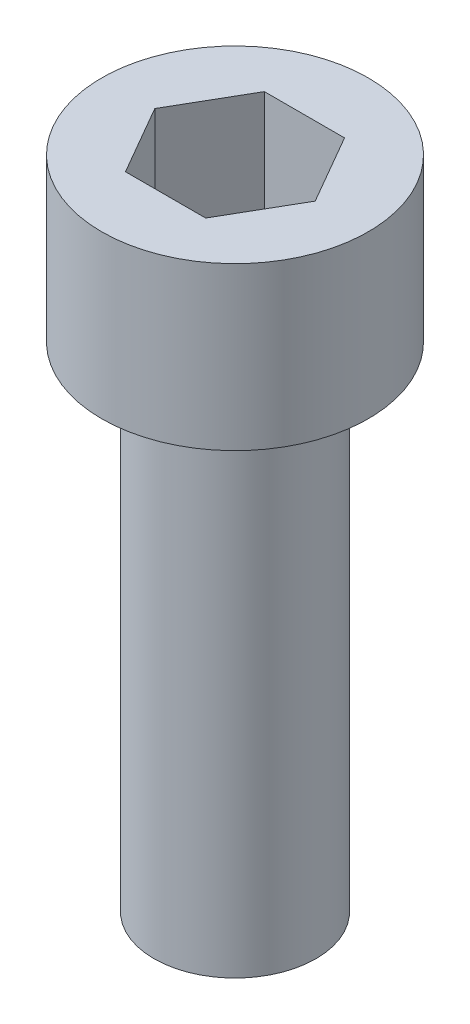
ISO-10303-21;
HEADER;
FILE_DESCRIPTION(('STEP AP214'),'2;1');
FILE_NAME('part.step','',(''),(''),'','','');
FILE_SCHEMA(('AUTOMOTIVE_DESIGN { 1 0 10303 214 1 1 1 1 }'));
ENDSEC;
DATA;
#1=APPLICATION_CONTEXT('core data for automotive mechanical design processes');
#2=APPLICATION_PROTOCOL_DEFINITION('international standard','automotive_design',2000,#1);
#3=PRODUCT_CONTEXT('',#1,'mechanical');
#4=PRODUCT('Part','Part','',(#3));
#5=PRODUCT_RELATED_PRODUCT_CATEGORY('part','',(#4));
#6=PRODUCT_DEFINITION_FORMATION('','',#4);
#7=PRODUCT_DEFINITION_CONTEXT('part definition',#1,'design');
#8=PRODUCT_DEFINITION('design','',#6,#7);
#9=PRODUCT_DEFINITION_SHAPE('','',#8);
#10=(LENGTH_UNIT() NAMED_UNIT(*) SI_UNIT(.MILLI.,.METRE.));
#11=(NAMED_UNIT(*) PLANE_ANGLE_UNIT() SI_UNIT($,.RADIAN.));
#12=(NAMED_UNIT(*) SI_UNIT($,.STERADIAN.) SOLID_ANGLE_UNIT());
#13=UNCERTAINTY_MEASURE_WITH_UNIT(LENGTH_MEASURE(1.E-05),#10,'distance_accuracy_value','');
#14=(GEOMETRIC_REPRESENTATION_CONTEXT(3) GLOBAL_UNCERTAINTY_ASSIGNED_CONTEXT((#13)) GLOBAL_UNIT_ASSIGNED_CONTEXT((#10,
#11,#12)) REPRESENTATION_CONTEXT('',''));
#15=CARTESIAN_POINT('',(0.,0.,0.));
#16=DIRECTION('',(0.,0.,1.));
#17=DIRECTION('',(1.,0.,0.));
#18=AXIS2_PLACEMENT_3D('',#15,#16,#17);
#19=CARTESIAN_POINT('',(0.,4.1656,0.));
#20=DIRECTION('',(0.,-1.,0.));
#21=DIRECTION('',(0.,0.,-1.));
#22=AXIS2_PLACEMENT_3D('',#19,#20,#21);
#23=PLANE('',#22);
#24=DIRECTION('',(-0.5,0.,-0.866025403784438));
#25=VECTOR('',#24,1.);
#26=CARTESIAN_POINT('',(2.06222299276169,4.1656,0.));
#27=LINE('',#26,#25);
#28=CARTESIAN_POINT('',(2.06222299276169,4.1656,0.));
#29=VERTEX_POINT('',#28);
#30=CARTESIAN_POINT('',(1.03111149638085,4.1656,-1.7859375));
#31=VERTEX_POINT('',#30);
#32=EDGE_CURVE('E122',#29,#31,#27,.T.);
#33=ORIENTED_EDGE('',*,*,#32,.F.);
#34=DIRECTION('',(0.5,0.,-0.866025403784439));
#35=VECTOR('',#34,1.);
#36=CARTESIAN_POINT('',(1.03111149638085,4.1656,1.7859375));
#37=LINE('',#36,#35);
#38=CARTESIAN_POINT('',(1.03111149638085,4.1656,1.7859375));
#39=VERTEX_POINT('',#38);
#40=EDGE_CURVE('E48',#39,#29,#37,.T.);
#41=ORIENTED_EDGE('',*,*,#40,.F.);
#42=DIRECTION('',(1.,0.,0.));
#43=VECTOR('',#42,1.);
#44=CARTESIAN_POINT('',(-1.03111149638085,4.1656,1.7859375));
#45=LINE('',#44,#43);
#46=CARTESIAN_POINT('',(-1.03111149638085,4.1656,1.7859375));
#47=VERTEX_POINT('',#46);
#48=EDGE_CURVE('E131',#47,#39,#45,.T.);
#49=ORIENTED_EDGE('',*,*,#48,.F.);
#50=DIRECTION('',(0.5,0.,0.866025403784438));
#51=VECTOR('',#50,1.);
#52=CARTESIAN_POINT('',(-2.06222299276169,4.1656,0.));
#53=LINE('',#52,#51);
#54=CARTESIAN_POINT('',(-2.06222299276169,4.1656,0.));
#55=VERTEX_POINT('',#54);
#56=EDGE_CURVE('E129',#55,#47,#53,.T.);
#57=ORIENTED_EDGE('',*,*,#56,.F.);
#58=DIRECTION('',(-0.5,0.,0.866025403784439));
#59=VECTOR('',#58,1.);
#60=CARTESIAN_POINT('',(-1.03111149638085,4.1656,-1.7859375));
#61=LINE('',#60,#59);
#62=CARTESIAN_POINT('',(-1.03111149638085,4.1656,-1.7859375));
#63=VERTEX_POINT('',#62);
#64=EDGE_CURVE('E96',#63,#55,#61,.T.);
#65=ORIENTED_EDGE('',*,*,#64,.F.);
#66=DIRECTION('',(-1.,0.,0.));
#67=VECTOR('',#66,1.);
#68=CARTESIAN_POINT('',(1.03111149638085,4.1656,-1.7859375));
#69=LINE('',#68,#67);
#70=EDGE_CURVE('E125',#31,#63,#69,.T.);
#71=ORIENTED_EDGE('',*,*,#70,.F.);
#72=EDGE_LOOP('',(#33,#41,#49,#57,#65,#71));
#73=FACE_BOUND('',#72,.T.);
#74=CARTESIAN_POINT('',(0.,4.1656,0.));
#75=DIRECTION('',(0.,1.,0.));
#76=DIRECTION('',(0.,0.,1.));
#77=AXIS2_PLACEMENT_3D('',#74,#75,#76);
#78=CIRCLE('',#77,3.429);
#79=CARTESIAN_POINT('',(0.,4.1656,3.429));
#80=VERTEX_POINT('',#79);
#81=EDGE_CURVE('E11',#80,#80,#78,.T.);
#82=ORIENTED_EDGE('',*,*,#81,.T.);
#83=EDGE_LOOP('',(#82));
#84=FACE_BOUND('',#83,.T.);
#85=ADVANCED_FACE('F34',(#73,#84),#23,.F.);
#86=CARTESIAN_POINT('',(0.,9.90721096543505,0.));
#87=DIRECTION('',(0.,1.,0.));
#88=DIRECTION('',(0.,0.,1.));
#89=AXIS2_PLACEMENT_3D('',#86,#87,#88);
#90=CYLINDRICAL_SURFACE('',#89,3.429);
#91=ORIENTED_EDGE('',*,*,#81,.F.);
#92=EDGE_LOOP('',(#91));
#93=FACE_BOUND('',#92,.T.);
#94=CARTESIAN_POINT('',(0.,0.,0.));
#95=DIRECTION('',(0.,1.,0.));
#96=DIRECTION('',(0.,0.,1.));
#97=AXIS2_PLACEMENT_3D('',#94,#95,#96);
#98=CIRCLE('',#97,3.429);
#99=CARTESIAN_POINT('',(0.,0.,3.429));
#100=VERTEX_POINT('',#99);
#101=EDGE_CURVE('E41',#100,#100,#98,.T.);
#102=ORIENTED_EDGE('',*,*,#101,.T.);
#103=EDGE_LOOP('',(#102));
#104=FACE_BOUND('',#103,.T.);
#105=ADVANCED_FACE('F148',(#93,#104),#90,.T.);
#106=CARTESIAN_POINT('',(3.429,0.,0.));
#107=DIRECTION('',(0.,1.,0.));
#108=DIRECTION('',(0.,0.,1.));
#109=AXIS2_PLACEMENT_3D('',#106,#107,#108);
#110=PLANE('',#109);
#111=ORIENTED_EDGE('',*,*,#101,.F.);
#112=EDGE_LOOP('',(#111));
#113=FACE_BOUND('',#112,.T.);
#114=CARTESIAN_POINT('',(0.,0.,0.));
#115=DIRECTION('',(0.,1.,0.));
#116=DIRECTION('',(0.,0.,1.));
#117=AXIS2_PLACEMENT_3D('',#114,#115,#116);
#118=CIRCLE('',#117,2.0828);
#119=CARTESIAN_POINT('',(0.,0.,2.0828));
#120=VERTEX_POINT('',#119);
#121=EDGE_CURVE('E143',#120,#120,#118,.T.);
#122=ORIENTED_EDGE('',*,*,#121,.T.);
#123=EDGE_LOOP('',(#122));
#124=FACE_BOUND('',#123,.T.);
#125=ADVANCED_FACE('F150',(#113,#124),#110,.F.);
#126=CARTESIAN_POINT('',(0.,9.90721096543505,0.));
#127=DIRECTION('',(0.,1.,0.));
#128=DIRECTION('',(0.,0.,1.));
#129=AXIS2_PLACEMENT_3D('',#126,#127,#128);
#130=CYLINDRICAL_SURFACE('',#129,2.0828);
#131=ORIENTED_EDGE('',*,*,#121,.F.);
#132=EDGE_LOOP('',(#131));
#133=FACE_BOUND('',#132,.T.);
#134=CARTESIAN_POINT('',(0.,-12.7,0.));
#135=DIRECTION('',(0.,1.,0.));
#136=DIRECTION('',(0.,0.,1.));
#137=AXIS2_PLACEMENT_3D('',#134,#135,#136);
#138=CIRCLE('',#137,2.0828);
#139=CARTESIAN_POINT('',(0.,-12.7,2.0828));
#140=VERTEX_POINT('',#139);
#141=EDGE_CURVE('E135',#140,#140,#138,.T.);
#142=ORIENTED_EDGE('',*,*,#141,.T.);
#143=EDGE_LOOP('',(#142));
#144=FACE_BOUND('',#143,.T.);
#145=ADVANCED_FACE('F153',(#133,#144),#130,.T.);
#146=CARTESIAN_POINT('',(2.0828,-12.7,0.));
#147=DIRECTION('',(0.,1.,0.));
#148=DIRECTION('',(0.,0.,1.));
#149=AXIS2_PLACEMENT_3D('',#146,#147,#148);
#150=PLANE('',#149);
#151=ORIENTED_EDGE('',*,*,#141,.F.);
#152=EDGE_LOOP('',(#151));
#153=FACE_BOUND('',#152,.T.);
#154=ADVANCED_FACE('F159',(#153),#150,.F.);
#155=CARTESIAN_POINT('',(1.03111149638085,0.593725,1.7859375));
#156=DIRECTION('',(0.866025403784439,0.,0.5));
#157=DIRECTION('',(0.5,0.,-0.866025403784439));
#158=AXIS2_PLACEMENT_3D('',#155,#156,#157);
#159=PLANE('',#158);
#160=ORIENTED_EDGE('',*,*,#40,.T.);
#161=DIRECTION('',(0.,1.,0.));
#162=VECTOR('',#161,1.);
#163=CARTESIAN_POINT('',(2.06222299276169,0.593725,0.));
#164=LINE('',#163,#162);
#165=CARTESIAN_POINT('',(2.06222299276169,0.593725,0.));
#166=VERTEX_POINT('',#165);
#167=EDGE_CURVE('E78',#166,#29,#164,.T.);
#168=ORIENTED_EDGE('',*,*,#167,.F.);
#169=DIRECTION('',(0.5,0.,-0.866025403784439));
#170=VECTOR('',#169,1.);
#171=CARTESIAN_POINT('',(1.03111149638085,0.593725,1.7859375));
#172=LINE('',#171,#170);
#173=CARTESIAN_POINT('',(1.03111149638085,0.593725,1.7859375));
#174=VERTEX_POINT('',#173);
#175=EDGE_CURVE('E133',#174,#166,#172,.T.);
#176=ORIENTED_EDGE('',*,*,#175,.F.);
#177=DIRECTION('',(0.,1.,0.));
#178=VECTOR('',#177,1.);
#179=CARTESIAN_POINT('',(1.03111149638085,0.593725,1.7859375));
#180=LINE('',#179,#178);
#181=EDGE_CURVE('E56',#174,#39,#180,.T.);
#182=ORIENTED_EDGE('',*,*,#181,.T.);
#183=EDGE_LOOP('',(#160,#168,#176,#182));
#184=FACE_BOUND('',#183,.T.);
#185=ADVANCED_FACE('F164',(#184),#159,.F.);
#186=CARTESIAN_POINT('',(-1.03111149638085,0.593725,1.7859375));
#187=DIRECTION('',(0.,0.,1.));
#188=DIRECTION('',(1.,0.,0.));
#189=AXIS2_PLACEMENT_3D('',#186,#187,#188);
#190=PLANE('',#189);
#191=ORIENTED_EDGE('',*,*,#48,.T.);
#192=ORIENTED_EDGE('',*,*,#181,.F.);
#193=DIRECTION('',(1.,0.,0.));
#194=VECTOR('',#193,1.);
#195=CARTESIAN_POINT('',(-1.03111149638085,0.593725,1.7859375));
#196=LINE('',#195,#194);
#197=CARTESIAN_POINT('',(-1.03111149638085,0.593725,1.7859375));
#198=VERTEX_POINT('',#197);
#199=EDGE_CURVE('E108',#198,#174,#196,.T.);
#200=ORIENTED_EDGE('',*,*,#199,.F.);
#201=DIRECTION('',(0.,1.,0.));
#202=VECTOR('',#201,1.);
#203=CARTESIAN_POINT('',(-1.03111149638085,0.593725,1.7859375));
#204=LINE('',#203,#202);
#205=EDGE_CURVE('E100',#198,#47,#204,.T.);
#206=ORIENTED_EDGE('',*,*,#205,.T.);
#207=EDGE_LOOP('',(#191,#192,#200,#206));
#208=FACE_BOUND('',#207,.T.);
#209=ADVANCED_FACE('F169',(#208),#190,.F.);
#210=CARTESIAN_POINT('',(-2.06222299276169,0.593725,0.));
#211=DIRECTION('',(-0.866025403784438,0.,0.5));
#212=DIRECTION('',(0.5,0.,0.866025403784439));
#213=AXIS2_PLACEMENT_3D('',#210,#211,#212);
#214=PLANE('',#213);
#215=ORIENTED_EDGE('',*,*,#56,.T.);
#216=ORIENTED_EDGE('',*,*,#205,.F.);
#217=DIRECTION('',(0.5,0.,0.866025403784438));
#218=VECTOR('',#217,1.);
#219=CARTESIAN_POINT('',(-2.06222299276169,0.593725,0.));
#220=LINE('',#219,#218);
#221=CARTESIAN_POINT('',(-2.06222299276169,0.593725,0.));
#222=VERTEX_POINT('',#221);
#223=EDGE_CURVE('E104',#222,#198,#220,.T.);
#224=ORIENTED_EDGE('',*,*,#223,.F.);
#225=DIRECTION('',(0.,1.,0.));
#226=VECTOR('',#225,1.);
#227=CARTESIAN_POINT('',(-2.06222299276169,0.593725,0.));
#228=LINE('',#227,#226);
#229=EDGE_CURVE('E89',#222,#55,#228,.T.);
#230=ORIENTED_EDGE('',*,*,#229,.T.);
#231=EDGE_LOOP('',(#215,#216,#224,#230));
#232=FACE_BOUND('',#231,.T.);
#233=ADVANCED_FACE('F105',(#232),#214,.F.);
#234=CARTESIAN_POINT('',(-1.03111149638085,0.593725,-1.7859375));
#235=DIRECTION('',(-0.866025403784439,0.,-0.5));
#236=DIRECTION('',(-0.5,0.,0.866025403784439));
#237=AXIS2_PLACEMENT_3D('',#234,#235,#236);
#238=PLANE('',#237);
#239=ORIENTED_EDGE('',*,*,#64,.T.);
#240=ORIENTED_EDGE('',*,*,#229,.F.);
#241=DIRECTION('',(-0.5,0.,0.866025403784439));
#242=VECTOR('',#241,1.);
#243=CARTESIAN_POINT('',(-1.03111149638085,0.593725,-1.7859375));
#244=LINE('',#243,#242);
#245=CARTESIAN_POINT('',(-1.03111149638085,0.593725,-1.7859375));
#246=VERTEX_POINT('',#245);
#247=EDGE_CURVE('E93',#246,#222,#244,.T.);
#248=ORIENTED_EDGE('',*,*,#247,.F.);
#249=DIRECTION('',(0.,1.,0.));
#250=VECTOR('',#249,1.);
#251=CARTESIAN_POINT('',(-1.03111149638085,0.593725,-1.7859375));
#252=LINE('',#251,#250);
#253=EDGE_CURVE('E101',#246,#63,#252,.T.);
#254=ORIENTED_EDGE('',*,*,#253,.T.);
#255=EDGE_LOOP('',(#239,#240,#248,#254));
#256=FACE_BOUND('',#255,.T.);
#257=ADVANCED_FACE('F91',(#256),#238,.F.);
#258=CARTESIAN_POINT('',(1.03111149638085,0.593725,-1.7859375));
#259=DIRECTION('',(0.,0.,-1.));
#260=DIRECTION('',(-1.,0.,0.));
#261=AXIS2_PLACEMENT_3D('',#258,#259,#260);
#262=PLANE('',#261);
#263=ORIENTED_EDGE('',*,*,#70,.T.);
#264=ORIENTED_EDGE('',*,*,#253,.F.);
#265=DIRECTION('',(-1.,0.,0.));
#266=VECTOR('',#265,1.);
#267=CARTESIAN_POINT('',(1.03111149638085,0.593725,-1.7859375));
#268=LINE('',#267,#266);
#269=CARTESIAN_POINT('',(1.03111149638085,0.593725,-1.7859375));
#270=VERTEX_POINT('',#269);
#271=EDGE_CURVE('E114',#270,#246,#268,.T.);
#272=ORIENTED_EDGE('',*,*,#271,.F.);
#273=DIRECTION('',(0.,1.,0.));
#274=VECTOR('',#273,1.);
#275=CARTESIAN_POINT('',(1.03111149638085,0.593725,-1.7859375));
#276=LINE('',#275,#274);
#277=EDGE_CURVE('E138',#270,#31,#276,.T.);
#278=ORIENTED_EDGE('',*,*,#277,.T.);
#279=EDGE_LOOP('',(#263,#264,#272,#278));
#280=FACE_BOUND('',#279,.T.);
#281=ADVANCED_FACE('F195',(#280),#262,.F.);
#282=CARTESIAN_POINT('',(2.06222299276169,0.593725,0.));
#283=DIRECTION('',(0.866025403784438,0.,-0.5));
#284=DIRECTION('',(-0.5,0.,-0.866025403784439));
#285=AXIS2_PLACEMENT_3D('',#282,#283,#284);
#286=PLANE('',#285);
#287=ORIENTED_EDGE('',*,*,#32,.T.);
#288=ORIENTED_EDGE('',*,*,#277,.F.);
#289=DIRECTION('',(-0.5,0.,-0.866025403784438));
#290=VECTOR('',#289,1.);
#291=CARTESIAN_POINT('',(2.06222299276169,0.593725,0.));
#292=LINE('',#291,#290);
#293=EDGE_CURVE('E116',#166,#270,#292,.T.);
#294=ORIENTED_EDGE('',*,*,#293,.F.);
#295=ORIENTED_EDGE('',*,*,#167,.T.);
#296=EDGE_LOOP('',(#287,#288,#294,#295));
#297=FACE_BOUND('',#296,.T.);
#298=ADVANCED_FACE('F183',(#297),#286,.F.);
#299=CARTESIAN_POINT('',(0.,0.593725,0.));
#300=DIRECTION('',(0.,1.,0.));
#301=DIRECTION('',(0.,0.,1.));
#302=AXIS2_PLACEMENT_3D('',#299,#300,#301);
#303=PLANE('',#302);
#304=ORIENTED_EDGE('',*,*,#175,.T.);
#305=ORIENTED_EDGE('',*,*,#293,.T.);
#306=ORIENTED_EDGE('',*,*,#271,.T.);
#307=ORIENTED_EDGE('',*,*,#247,.T.);
#308=ORIENTED_EDGE('',*,*,#223,.T.);
#309=ORIENTED_EDGE('',*,*,#199,.T.);
#310=EDGE_LOOP('',(#304,#305,#306,#307,#308,#309));
#311=FACE_BOUND('',#310,.T.);
#312=ADVANCED_FACE('F111',(#311),#303,.T.);
#313=CLOSED_SHELL('',(#85,#105,#125,#145,#154,#185,#209,#233,#257,#281,#298,#312));
#314=MANIFOLD_SOLID_BREP('B2',#313);
#315=ADVANCED_BREP_SHAPE_REPRESENTATION('',(#18,#314),#14);
#316=SHAPE_DEFINITION_REPRESENTATION(#9,#315);
ENDSEC;
END-ISO-10303-21;
